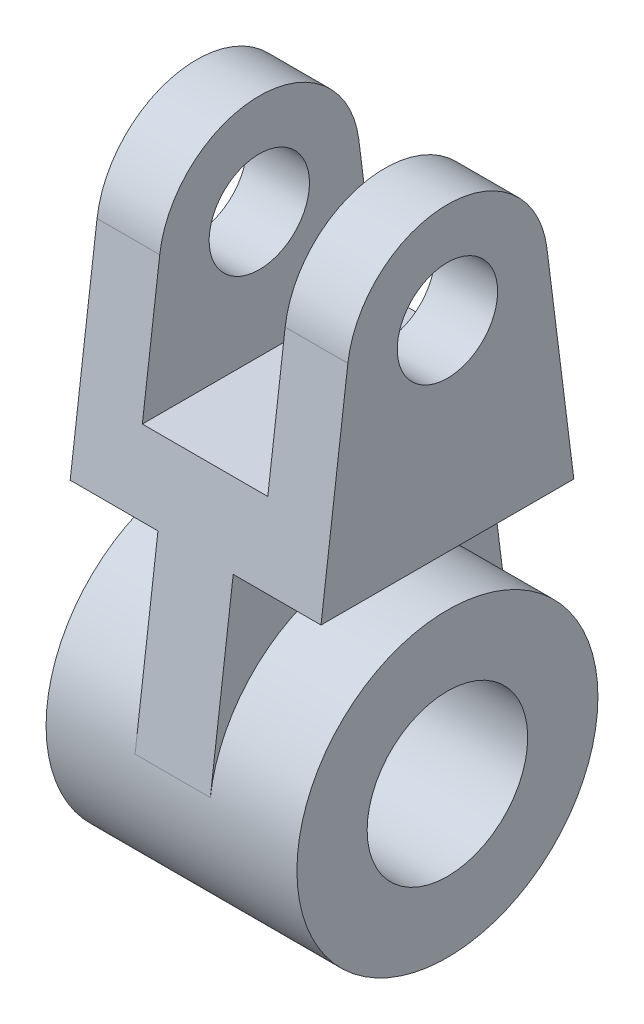
ISO-10303-21;
HEADER;
FILE_DESCRIPTION(('STEP AP214'),'2;1');
FILE_NAME('part.step','',(''),(''),'','','');
FILE_SCHEMA(('AUTOMOTIVE_DESIGN { 1 0 10303 214 1 1 1 1 }'));
ENDSEC;
DATA;
#1=APPLICATION_CONTEXT('core data for automotive mechanical design processes');
#2=APPLICATION_PROTOCOL_DEFINITION('international standard','automotive_design',2000,#1);
#3=PRODUCT_CONTEXT('',#1,'mechanical');
#4=PRODUCT('Part','Part','',(#3));
#5=PRODUCT_RELATED_PRODUCT_CATEGORY('part','',(#4));
#6=PRODUCT_DEFINITION_FORMATION('','',#4);
#7=PRODUCT_DEFINITION_CONTEXT('part definition',#1,'design');
#8=PRODUCT_DEFINITION('design','',#6,#7);
#9=PRODUCT_DEFINITION_SHAPE('','',#8);
#10=(LENGTH_UNIT() NAMED_UNIT(*) SI_UNIT(.MILLI.,.METRE.));
#11=(NAMED_UNIT(*) PLANE_ANGLE_UNIT() SI_UNIT($,.RADIAN.));
#12=(NAMED_UNIT(*) SI_UNIT($,.STERADIAN.) SOLID_ANGLE_UNIT());
#13=UNCERTAINTY_MEASURE_WITH_UNIT(LENGTH_MEASURE(1.E-05),#10,'distance_accuracy_value','');
#14=(GEOMETRIC_REPRESENTATION_CONTEXT(3) GLOBAL_UNCERTAINTY_ASSIGNED_CONTEXT((#13)) GLOBAL_UNIT_ASSIGNED_CONTEXT((#10,
#11,#12)) REPRESENTATION_CONTEXT('',''));
#15=CARTESIAN_POINT('',(0.,0.,0.));
#16=DIRECTION('',(0.,0.,1.));
#17=DIRECTION('',(1.,0.,0.));
#18=AXIS2_PLACEMENT_3D('',#15,#16,#17);
#19=CARTESIAN_POINT('',(25.,80.,0.));
#20=DIRECTION('',(-1.,0.,0.));
#21=DIRECTION('',(0.,0.,1.));
#22=AXIS2_PLACEMENT_3D('',#19,#20,#21);
#23=CYLINDRICAL_SURFACE('',#22,20.);
#24=CARTESIAN_POINT('',(-12.5,80.,0.));
#25=DIRECTION('',(-1.,0.,0.));
#26=DIRECTION('',(0.,-1.,0.));
#27=AXIS2_PLACEMENT_3D('',#24,#25,#26);
#28=CIRCLE('',#27,20.);
#29=CARTESIAN_POINT('',(-12.5,82.5,19.8431348329844));
#30=VERTEX_POINT('',#29);
#31=CARTESIAN_POINT('',(-12.5,82.5,-19.8431348329844));
#32=VERTEX_POINT('',#31);
#33=EDGE_CURVE('E152',#30,#32,#28,.T.);
#34=ORIENTED_EDGE('',*,*,#33,.T.);
#35=DIRECTION('',(-1.,0.,0.));
#36=VECTOR('',#35,1.);
#37=CARTESIAN_POINT('',(25.,82.5,-19.8431348329844));
#38=LINE('',#37,#36);
#39=CARTESIAN_POINT('',(-25.,82.5,-19.8431348329844));
#40=VERTEX_POINT('',#39);
#41=EDGE_CURVE('E150',#32,#40,#38,.T.);
#42=ORIENTED_EDGE('',*,*,#41,.T.);
#43=CARTESIAN_POINT('',(-25.,80.,0.));
#44=DIRECTION('',(1.,0.,0.));
#45=DIRECTION('',(0.,0.,-1.));
#46=AXIS2_PLACEMENT_3D('',#43,#44,#45);
#47=CIRCLE('',#46,20.);
#48=CARTESIAN_POINT('',(-25.,82.5,19.8431348329844));
#49=VERTEX_POINT('',#48);
#50=EDGE_CURVE('E201',#40,#49,#47,.T.);
#51=ORIENTED_EDGE('',*,*,#50,.T.);
#52=DIRECTION('',(-1.,0.,0.));
#53=VECTOR('',#52,1.);
#54=CARTESIAN_POINT('',(25.,82.5,19.8431348329844));
#55=LINE('',#54,#53);
#56=EDGE_CURVE('E221',#30,#49,#55,.T.);
#57=ORIENTED_EDGE('',*,*,#56,.F.);
#58=EDGE_LOOP('',(#34,#42,#51,#57));
#59=FACE_BOUND('',#58,.T.);
#60=ADVANCED_FACE('F41',(#59),#23,.T.);
#61=CARTESIAN_POINT('',(-25.,80.,0.));
#62=DIRECTION('',(1.,0.,0.));
#63=DIRECTION('',(0.,0.,-1.));
#64=AXIS2_PLACEMENT_3D('',#61,#62,#63);
#65=CYLINDRICAL_SURFACE('',#64,10.);
#66=CARTESIAN_POINT('',(12.5,80.,0.));
#67=DIRECTION('',(1.,0.,0.));
#68=DIRECTION('',(0.,1.,0.));
#69=AXIS2_PLACEMENT_3D('',#66,#67,#68);
#70=CIRCLE('',#69,10.);
#71=CARTESIAN_POINT('',(12.5,90.,0.));
#72=VERTEX_POINT('',#71);
#73=EDGE_CURVE('E156',#72,#72,#70,.F.);
#74=ORIENTED_EDGE('',*,*,#73,.T.);
#75=EDGE_LOOP('',(#74));
#76=FACE_BOUND('',#75,.T.);
#77=CARTESIAN_POINT('',(25.,80.,0.));
#78=DIRECTION('',(1.,0.,0.));
#79=DIRECTION('',(0.,0.,-1.));
#80=AXIS2_PLACEMENT_3D('',#77,#78,#79);
#81=CIRCLE('',#80,10.);
#82=CARTESIAN_POINT('',(25.,80.,-10.));
#83=VERTEX_POINT('',#82);
#84=EDGE_CURVE('E175',#83,#83,#81,.T.);
#85=ORIENTED_EDGE('',*,*,#84,.T.);
#86=EDGE_LOOP('',(#85));
#87=FACE_BOUND('',#86,.T.);
#88=ADVANCED_FACE('F283',(#76,#87),#65,.F.);
#89=CARTESIAN_POINT('',(25.,0.,0.));
#90=DIRECTION('',(-1.,0.,0.));
#91=DIRECTION('',(0.,0.,1.));
#92=AXIS2_PLACEMENT_3D('',#89,#90,#91);
#93=CYLINDRICAL_SURFACE('',#92,30.);
#94=DIRECTION('',(-1.,0.,0.));
#95=VECTOR('',#94,1.);
#96=CARTESIAN_POINT('',(7.5,3.75,-29.7647022494766));
#97=LINE('',#96,#95);
#98=CARTESIAN_POINT('',(7.5,3.75,-29.7647022494766));
#99=VERTEX_POINT('',#98);
#100=CARTESIAN_POINT('',(-7.5,3.75,-29.7647022494766));
#101=VERTEX_POINT('',#100);
#102=EDGE_CURVE('E62',#99,#101,#97,.T.);
#103=ORIENTED_EDGE('',*,*,#102,.F.);
#104=CARTESIAN_POINT('',(7.5,0.,0.));
#105=DIRECTION('',(1.,0.,0.));
#106=DIRECTION('',(0.,0.,-1.));
#107=AXIS2_PLACEMENT_3D('',#104,#105,#106);
#108=CIRCLE('',#107,30.);
#109=CARTESIAN_POINT('',(7.5,3.75,29.7647022494766));
#110=VERTEX_POINT('',#109);
#111=EDGE_CURVE('E57',#99,#110,#108,.T.);
#112=ORIENTED_EDGE('',*,*,#111,.T.);
#113=DIRECTION('',(-1.,0.,0.));
#114=VECTOR('',#113,1.);
#115=CARTESIAN_POINT('',(7.5,3.75,29.7647022494766));
#116=LINE('',#115,#114);
#117=CARTESIAN_POINT('',(-7.5,3.75,29.7647022494766));
#118=VERTEX_POINT('',#117);
#119=EDGE_CURVE('E259',#110,#118,#116,.T.);
#120=ORIENTED_EDGE('',*,*,#119,.T.);
#121=CARTESIAN_POINT('',(-7.5,0.,0.));
#122=DIRECTION('',(1.,0.,0.));
#123=DIRECTION('',(0.,0.,-1.));
#124=AXIS2_PLACEMENT_3D('',#121,#122,#123);
#125=CIRCLE('',#124,30.);
#126=EDGE_CURVE('E251',#101,#118,#125,.T.);
#127=ORIENTED_EDGE('',*,*,#126,.F.);
#128=EDGE_LOOP('',(#103,#112,#120,#127));
#129=FACE_BOUND('',#128,.T.);
#130=CARTESIAN_POINT('',(25.,0.,0.));
#131=DIRECTION('',(1.,0.,0.));
#132=DIRECTION('',(0.,0.,-1.));
#133=AXIS2_PLACEMENT_3D('',#130,#131,#132);
#134=CIRCLE('',#133,30.);
#135=CARTESIAN_POINT('',(25.,0.,-30.));
#136=VERTEX_POINT('',#135);
#137=EDGE_CURVE('E50',#136,#136,#134,.T.);
#138=ORIENTED_EDGE('',*,*,#137,.F.);
#139=EDGE_LOOP('',(#138));
#140=FACE_BOUND('',#139,.T.);
#141=CARTESIAN_POINT('',(-25.,0.,0.));
#142=DIRECTION('',(1.,0.,0.));
#143=DIRECTION('',(0.,0.,-1.));
#144=AXIS2_PLACEMENT_3D('',#141,#142,#143);
#145=CIRCLE('',#144,30.);
#146=CARTESIAN_POINT('',(-25.,0.,-30.));
#147=VERTEX_POINT('',#146);
#148=EDGE_CURVE('E267',#147,#147,#145,.T.);
#149=ORIENTED_EDGE('',*,*,#148,.T.);
#150=EDGE_LOOP('',(#149));
#151=FACE_BOUND('',#150,.T.);
#152=ADVANCED_FACE('F43',(#129,#140,#151),#93,.T.);
#153=CARTESIAN_POINT('',(25.,0.,0.));
#154=DIRECTION('',(1.,0.,0.));
#155=DIRECTION('',(0.,0.,-1.));
#156=AXIS2_PLACEMENT_3D('',#153,#154,#155);
#157=PLANE('',#156);
#158=CARTESIAN_POINT('',(25.,0.,0.));
#159=DIRECTION('',(1.,0.,0.));
#160=DIRECTION('',(0.,0.,-1.));
#161=AXIS2_PLACEMENT_3D('',#158,#159,#160);
#162=CIRCLE('',#161,16.);
#163=CARTESIAN_POINT('',(25.,0.,-16.));
#164=VERTEX_POINT('',#163);
#165=EDGE_CURVE('E262',#164,#164,#162,.T.);
#166=ORIENTED_EDGE('',*,*,#165,.F.);
#167=EDGE_LOOP('',(#166));
#168=FACE_BOUND('',#167,.T.);
#169=ORIENTED_EDGE('',*,*,#137,.T.);
#170=EDGE_LOOP('',(#169));
#171=FACE_BOUND('',#170,.T.);
#172=ADVANCED_FACE('F373',(#168,#171),#157,.T.);
#173=CARTESIAN_POINT('',(-25.,0.,0.));
#174=DIRECTION('',(1.,0.,0.));
#175=DIRECTION('',(0.,0.,-1.));
#176=AXIS2_PLACEMENT_3D('',#173,#174,#175);
#177=PLANE('',#176);
#178=CARTESIAN_POINT('',(-25.,0.,0.));
#179=DIRECTION('',(1.,0.,0.));
#180=DIRECTION('',(0.,0.,-1.));
#181=AXIS2_PLACEMENT_3D('',#178,#179,#180);
#182=CIRCLE('',#181,16.);
#183=CARTESIAN_POINT('',(-25.,0.,-16.));
#184=VERTEX_POINT('',#183);
#185=EDGE_CURVE('E263',#184,#184,#182,.T.);
#186=ORIENTED_EDGE('',*,*,#185,.T.);
#187=EDGE_LOOP('',(#186));
#188=FACE_BOUND('',#187,.T.);
#189=ORIENTED_EDGE('',*,*,#148,.F.);
#190=EDGE_LOOP('',(#189));
#191=FACE_BOUND('',#190,.T.);
#192=ADVANCED_FACE('F371',(#188,#191),#177,.F.);
#193=CARTESIAN_POINT('',(-25.,0.,0.));
#194=DIRECTION('',(1.,0.,0.));
#195=DIRECTION('',(0.,0.,-1.));
#196=AXIS2_PLACEMENT_3D('',#193,#194,#195);
#197=CYLINDRICAL_SURFACE('',#196,16.);
#198=ORIENTED_EDGE('',*,*,#185,.F.);
#199=EDGE_LOOP('',(#198));
#200=FACE_BOUND('',#199,.T.);
#201=ORIENTED_EDGE('',*,*,#165,.T.);
#202=EDGE_LOOP('',(#201));
#203=FACE_BOUND('',#202,.T.);
#204=ADVANCED_FACE('F368',(#200,#203),#197,.F.);
#205=CARTESIAN_POINT('',(7.5,3.75,29.7647022494766));
#206=DIRECTION('',(0.,-0.125,-0.992156741649222));
#207=DIRECTION('',(0.,0.992156741649222,-0.125));
#208=AXIS2_PLACEMENT_3D('',#205,#206,#207);
#209=PLANE('',#208);
#210=CARTESIAN_POINT('',(25.,82.5,19.8431348329844));
#211=VERTEX_POINT('',#210);
#212=CARTESIAN_POINT('',(12.5,82.5,19.8431348329844));
#213=VERTEX_POINT('',#212);
#214=EDGE_CURVE('E222',#211,#213,#55,.T.);
#215=ORIENTED_EDGE('',*,*,#214,.T.);
#216=DIRECTION('',(0.,-0.992156741649222,0.125));
#217=VECTOR('',#216,1.);
#218=CARTESIAN_POINT('',(12.5,3.75,29.7647022494766));
#219=LINE('',#218,#217);
#220=CARTESIAN_POINT('',(12.5,55.,23.3078091689023));
#221=VERTEX_POINT('',#220);
#222=EDGE_CURVE('E168',#213,#221,#219,.T.);
#223=ORIENTED_EDGE('',*,*,#222,.T.);
#224=DIRECTION('',(-1.,0.,0.));
#225=VECTOR('',#224,1.);
#226=CARTESIAN_POINT('',(7.5,55.,23.3078091689023));
#227=LINE('',#226,#225);
#228=CARTESIAN_POINT('',(-12.5,55.,23.3078091689023));
#229=VERTEX_POINT('',#228);
#230=EDGE_CURVE('E172',#221,#229,#227,.T.);
#231=ORIENTED_EDGE('',*,*,#230,.T.);
#232=DIRECTION('',(0.,0.992156741649222,-0.125));
#233=VECTOR('',#232,1.);
#234=CARTESIAN_POINT('',(-12.5,3.74999999999999,29.7647022494766));
#235=LINE('',#234,#233);
#236=EDGE_CURVE('E145',#229,#30,#235,.T.);
#237=ORIENTED_EDGE('',*,*,#236,.T.);
#238=ORIENTED_EDGE('',*,*,#56,.T.);
#239=DIRECTION('',(0.,-0.992156741649222,0.125));
#240=VECTOR('',#239,1.);
#241=CARTESIAN_POINT('',(-25.,3.75,29.7647022494766));
#242=LINE('',#241,#240);
#243=CARTESIAN_POINT('',(-25.,40.,25.1976315339485));
#244=VERTEX_POINT('',#243);
#245=EDGE_CURVE('E205',#49,#244,#242,.T.);
#246=ORIENTED_EDGE('',*,*,#245,.T.);
#247=DIRECTION('',(-1.,0.,0.));
#248=VECTOR('',#247,1.);
#249=CARTESIAN_POINT('',(25.,40.,25.1976315339485));
#250=LINE('',#249,#248);
#251=CARTESIAN_POINT('',(-7.5,40.,25.1976315339485));
#252=VERTEX_POINT('',#251);
#253=EDGE_CURVE('E216',#252,#244,#250,.T.);
#254=ORIENTED_EDGE('',*,*,#253,.F.);
#255=DIRECTION('',(0.,-0.992156741649222,0.125));
#256=VECTOR('',#255,1.);
#257=CARTESIAN_POINT('',(-7.5,3.75,29.7647022494766));
#258=LINE('',#257,#256);
#259=EDGE_CURVE('E247',#252,#118,#258,.T.);
#260=ORIENTED_EDGE('',*,*,#259,.T.);
#261=ORIENTED_EDGE('',*,*,#119,.F.);
#262=DIRECTION('',(0.,-0.992156741649222,0.125));
#263=VECTOR('',#262,1.);
#264=CARTESIAN_POINT('',(7.5,3.75,29.7647022494766));
#265=LINE('',#264,#263);
#266=CARTESIAN_POINT('',(7.5,40.,25.1976315339485));
#267=VERTEX_POINT('',#266);
#268=EDGE_CURVE('E235',#267,#110,#265,.T.);
#269=ORIENTED_EDGE('',*,*,#268,.F.);
#270=CARTESIAN_POINT('',(25.,40.,25.1976315339485));
#271=VERTEX_POINT('',#270);
#272=EDGE_CURVE('E217',#271,#267,#250,.T.);
#273=ORIENTED_EDGE('',*,*,#272,.F.);
#274=DIRECTION('',(0.,-0.992156741649222,0.125));
#275=VECTOR('',#274,1.);
#276=CARTESIAN_POINT('',(25.,3.75,29.7647022494766));
#277=LINE('',#276,#275);
#278=EDGE_CURVE('E192',#211,#271,#277,.T.);
#279=ORIENTED_EDGE('',*,*,#278,.F.);
#280=EDGE_LOOP('',(#215,#223,#231,#237,#238,#246,#254,#260,#261,#269,#273,#279));
#281=FACE_BOUND('',#280,.T.);
#282=ADVANCED_FACE('F308',(#281),#209,.F.);
#283=CARTESIAN_POINT('',(7.5,3.75,-29.7647022494766));
#284=DIRECTION('',(0.,-0.125,0.992156741649222));
#285=DIRECTION('',(0.,-0.992156741649222,-0.125));
#286=AXIS2_PLACEMENT_3D('',#283,#284,#285);
#287=PLANE('',#286);
#288=DIRECTION('',(1.,0.,0.));
#289=VECTOR('',#288,1.);
#290=CARTESIAN_POINT('',(7.5,55.,-23.3078091689023));
#291=LINE('',#290,#289);
#292=CARTESIAN_POINT('',(-12.5,55.,-23.3078091689023));
#293=VERTEX_POINT('',#292);
#294=CARTESIAN_POINT('',(12.5,55.,-23.3078091689023));
#295=VERTEX_POINT('',#294);
#296=EDGE_CURVE('E11',#293,#295,#291,.T.);
#297=ORIENTED_EDGE('',*,*,#296,.T.);
#298=DIRECTION('',(0.,0.992156741649222,0.125));
#299=VECTOR('',#298,1.);
#300=CARTESIAN_POINT('',(12.5,3.75,-29.7647022494766));
#301=LINE('',#300,#299);
#302=CARTESIAN_POINT('',(12.5,82.5,-19.8431348329844));
#303=VERTEX_POINT('',#302);
#304=EDGE_CURVE('E165',#295,#303,#301,.T.);
#305=ORIENTED_EDGE('',*,*,#304,.T.);
#306=CARTESIAN_POINT('',(25.,82.5,-19.8431348329844));
#307=VERTEX_POINT('',#306);
#308=EDGE_CURVE('E226',#307,#303,#38,.T.);
#309=ORIENTED_EDGE('',*,*,#308,.F.);
#310=DIRECTION('',(0.,0.992156741649222,0.125));
#311=VECTOR('',#310,1.);
#312=CARTESIAN_POINT('',(25.,3.75,-29.7647022494766));
#313=LINE('',#312,#311);
#314=CARTESIAN_POINT('',(25.,40.,-25.1976315339485));
#315=VERTEX_POINT('',#314);
#316=EDGE_CURVE('E184',#315,#307,#313,.T.);
#317=ORIENTED_EDGE('',*,*,#316,.F.);
#318=DIRECTION('',(-1.,0.,0.));
#319=VECTOR('',#318,1.);
#320=CARTESIAN_POINT('',(25.,40.,-25.1976315339485));
#321=LINE('',#320,#319);
#322=CARTESIAN_POINT('',(7.5,40.,-25.1976315339485));
#323=VERTEX_POINT('',#322);
#324=EDGE_CURVE('E212',#315,#323,#321,.T.);
#325=ORIENTED_EDGE('',*,*,#324,.T.);
#326=DIRECTION('',(0.,0.992156741649222,0.125));
#327=VECTOR('',#326,1.);
#328=CARTESIAN_POINT('',(7.5,3.75,-29.7647022494766));
#329=LINE('',#328,#327);
#330=EDGE_CURVE('E241',#99,#323,#329,.T.);
#331=ORIENTED_EDGE('',*,*,#330,.F.);
#332=ORIENTED_EDGE('',*,*,#102,.T.);
#333=DIRECTION('',(0.,0.992156741649222,0.125));
#334=VECTOR('',#333,1.);
#335=CARTESIAN_POINT('',(-7.5,3.75,-29.7647022494766));
#336=LINE('',#335,#334);
#337=CARTESIAN_POINT('',(-7.5,40.,-25.1976315339485));
#338=VERTEX_POINT('',#337);
#339=EDGE_CURVE('E236',#101,#338,#336,.T.);
#340=ORIENTED_EDGE('',*,*,#339,.T.);
#341=CARTESIAN_POINT('',(-25.,40.,-25.1976315339485));
#342=VERTEX_POINT('',#341);
#343=EDGE_CURVE('E198',#338,#342,#321,.T.);
#344=ORIENTED_EDGE('',*,*,#343,.T.);
#345=DIRECTION('',(0.,0.992156741649222,0.125));
#346=VECTOR('',#345,1.);
#347=CARTESIAN_POINT('',(-25.,3.75,-29.7647022494766));
#348=LINE('',#347,#346);
#349=EDGE_CURVE('E180',#342,#40,#348,.T.);
#350=ORIENTED_EDGE('',*,*,#349,.T.);
#351=ORIENTED_EDGE('',*,*,#41,.F.);
#352=DIRECTION('',(0.,-0.992156741649222,-0.125));
#353=VECTOR('',#352,1.);
#354=CARTESIAN_POINT('',(-12.5,3.74999999999999,-29.7647022494766));
#355=LINE('',#354,#353);
#356=EDGE_CURVE('E142',#32,#293,#355,.T.);
#357=ORIENTED_EDGE('',*,*,#356,.T.);
#358=EDGE_LOOP('',(#297,#305,#309,#317,#325,#331,#332,#340,#344,#350,#351,#357));
#359=FACE_BOUND('',#358,.T.);
#360=ADVANCED_FACE('F148',(#359),#287,.F.);
#361=CARTESIAN_POINT('',(7.5,0.,0.));
#362=DIRECTION('',(1.,0.,0.));
#363=DIRECTION('',(0.,0.,-1.));
#364=AXIS2_PLACEMENT_3D('',#361,#362,#363);
#365=PLANE('',#364);
#366=DIRECTION('',(0.,0.,-1.));
#367=VECTOR('',#366,1.);
#368=CARTESIAN_POINT('',(7.5,40.,0.));
#369=LINE('',#368,#367);
#370=EDGE_CURVE('E231',#267,#323,#369,.T.);
#371=ORIENTED_EDGE('',*,*,#370,.F.);
#372=ORIENTED_EDGE('',*,*,#268,.T.);
#373=ORIENTED_EDGE('',*,*,#111,.F.);
#374=ORIENTED_EDGE('',*,*,#330,.T.);
#375=EDGE_LOOP('',(#371,#372,#373,#374));
#376=FACE_BOUND('',#375,.T.);
#377=ADVANCED_FACE('F305',(#376),#365,.T.);
#378=CARTESIAN_POINT('',(-7.5,0.,0.));
#379=DIRECTION('',(1.,0.,0.));
#380=DIRECTION('',(0.,0.,-1.));
#381=AXIS2_PLACEMENT_3D('',#378,#379,#380);
#382=PLANE('',#381);
#383=DIRECTION('',(0.,0.,-1.));
#384=VECTOR('',#383,1.);
#385=CARTESIAN_POINT('',(-7.5,40.,0.));
#386=LINE('',#385,#384);
#387=EDGE_CURVE('E230',#252,#338,#386,.T.);
#388=ORIENTED_EDGE('',*,*,#387,.T.);
#389=ORIENTED_EDGE('',*,*,#339,.F.);
#390=ORIENTED_EDGE('',*,*,#126,.T.);
#391=ORIENTED_EDGE('',*,*,#259,.F.);
#392=EDGE_LOOP('',(#388,#389,#390,#391));
#393=FACE_BOUND('',#392,.T.);
#394=ADVANCED_FACE('F313',(#393),#382,.F.);
#395=CARTESIAN_POINT('',(25.,40.,0.));
#396=DIRECTION('',(0.,1.,0.));
#397=DIRECTION('',(0.,0.,1.));
#398=AXIS2_PLACEMENT_3D('',#395,#396,#397);
#399=PLANE('',#398);
#400=ORIENTED_EDGE('',*,*,#272,.T.);
#401=ORIENTED_EDGE('',*,*,#370,.T.);
#402=ORIENTED_EDGE('',*,*,#324,.F.);
#403=DIRECTION('',(0.,0.,-1.));
#404=VECTOR('',#403,1.);
#405=CARTESIAN_POINT('',(25.,40.,0.));
#406=LINE('',#405,#404);
#407=EDGE_CURVE('E195',#271,#315,#406,.T.);
#408=ORIENTED_EDGE('',*,*,#407,.F.);
#409=EDGE_LOOP('',(#400,#401,#402,#408));
#410=FACE_BOUND('',#409,.T.);
#411=ADVANCED_FACE('F301',(#410),#399,.F.);
#412=ORIENTED_EDGE('',*,*,#308,.T.);
#413=CARTESIAN_POINT('',(12.5,80.,0.));
#414=DIRECTION('',(1.,0.,0.));
#415=DIRECTION('',(0.,1.,0.));
#416=AXIS2_PLACEMENT_3D('',#413,#414,#415);
#417=CIRCLE('',#416,20.);
#418=EDGE_CURVE('E161',#303,#213,#417,.T.);
#419=ORIENTED_EDGE('',*,*,#418,.T.);
#420=ORIENTED_EDGE('',*,*,#214,.F.);
#421=CARTESIAN_POINT('',(25.,80.,0.));
#422=DIRECTION('',(1.,0.,0.));
#423=DIRECTION('',(0.,0.,-1.));
#424=AXIS2_PLACEMENT_3D('',#421,#422,#423);
#425=CIRCLE('',#424,20.);
#426=EDGE_CURVE('E188',#307,#211,#425,.T.);
#427=ORIENTED_EDGE('',*,*,#426,.F.);
#428=EDGE_LOOP('',(#412,#419,#420,#427));
#429=FACE_BOUND('',#428,.T.);
#430=ADVANCED_FACE('F294',(#429),#23,.T.);
#431=ORIENTED_EDGE('',*,*,#387,.F.);
#432=ORIENTED_EDGE('',*,*,#253,.T.);
#433=DIRECTION('',(0.,0.,-1.));
#434=VECTOR('',#433,1.);
#435=CARTESIAN_POINT('',(-25.,40.,0.));
#436=LINE('',#435,#434);
#437=EDGE_CURVE('E189',#244,#342,#436,.T.);
#438=ORIENTED_EDGE('',*,*,#437,.T.);
#439=ORIENTED_EDGE('',*,*,#343,.F.);
#440=EDGE_LOOP('',(#431,#432,#438,#439));
#441=FACE_BOUND('',#440,.T.);
#442=ADVANCED_FACE('F317',(#441),#399,.F.);
#443=CARTESIAN_POINT('',(25.,0.,0.));
#444=DIRECTION('',(1.,0.,0.));
#445=DIRECTION('',(0.,0.,-1.));
#446=AXIS2_PLACEMENT_3D('',#443,#444,#445);
#447=PLANE('',#446);
#448=ORIENTED_EDGE('',*,*,#84,.F.);
#449=EDGE_LOOP('',(#448));
#450=FACE_BOUND('',#449,.T.);
#451=ORIENTED_EDGE('',*,*,#316,.T.);
#452=ORIENTED_EDGE('',*,*,#426,.T.);
#453=ORIENTED_EDGE('',*,*,#278,.T.);
#454=ORIENTED_EDGE('',*,*,#407,.T.);
#455=EDGE_LOOP('',(#451,#452,#453,#454));
#456=FACE_BOUND('',#455,.T.);
#457=ADVANCED_FACE('F297',(#450,#456),#447,.T.);
#458=CARTESIAN_POINT('',(-25.,0.,0.));
#459=DIRECTION('',(1.,0.,0.));
#460=DIRECTION('',(0.,0.,-1.));
#461=AXIS2_PLACEMENT_3D('',#458,#459,#460);
#462=PLANE('',#461);
#463=CARTESIAN_POINT('',(-25.,80.,0.));
#464=DIRECTION('',(1.,0.,0.));
#465=DIRECTION('',(0.,0.,-1.));
#466=AXIS2_PLACEMENT_3D('',#463,#464,#465);
#467=CIRCLE('',#466,10.);
#468=CARTESIAN_POINT('',(-25.,80.,-10.));
#469=VERTEX_POINT('',#468);
#470=EDGE_CURVE('E176',#469,#469,#467,.T.);
#471=ORIENTED_EDGE('',*,*,#470,.T.);
#472=EDGE_LOOP('',(#471));
#473=FACE_BOUND('',#472,.T.);
#474=ORIENTED_EDGE('',*,*,#349,.F.);
#475=ORIENTED_EDGE('',*,*,#437,.F.);
#476=ORIENTED_EDGE('',*,*,#245,.F.);
#477=ORIENTED_EDGE('',*,*,#50,.F.);
#478=EDGE_LOOP('',(#474,#475,#476,#477));
#479=FACE_BOUND('',#478,.T.);
#480=ADVANCED_FACE('F329',(#473,#479),#462,.F.);
#481=CARTESIAN_POINT('',(-12.5,80.,0.));
#482=DIRECTION('',(-1.,0.,0.));
#483=DIRECTION('',(0.,-1.,0.));
#484=AXIS2_PLACEMENT_3D('',#481,#482,#483);
#485=CIRCLE('',#484,10.);
#486=CARTESIAN_POINT('',(-12.5,70.,0.));
#487=VERTEX_POINT('',#486);
#488=EDGE_CURVE('E158',#487,#487,#485,.F.);
#489=ORIENTED_EDGE('',*,*,#488,.T.);
#490=EDGE_LOOP('',(#489));
#491=FACE_BOUND('',#490,.T.);
#492=ORIENTED_EDGE('',*,*,#470,.F.);
#493=EDGE_LOOP('',(#492));
#494=FACE_BOUND('',#493,.T.);
#495=ADVANCED_FACE('F333',(#491,#494),#65,.F.);
#496=CARTESIAN_POINT('',(12.5,55.,-30.));
#497=DIRECTION('',(0.,-1.,0.));
#498=DIRECTION('',(0.,0.,-1.));
#499=AXIS2_PLACEMENT_3D('',#496,#497,#498);
#500=PLANE('',#499);
#501=DIRECTION('',(0.,0.,1.));
#502=VECTOR('',#501,1.);
#503=CARTESIAN_POINT('',(12.5,55.,-30.));
#504=LINE('',#503,#502);
#505=EDGE_CURVE('E135',#295,#221,#504,.T.);
#506=ORIENTED_EDGE('',*,*,#505,.F.);
#507=ORIENTED_EDGE('',*,*,#296,.F.);
#508=DIRECTION('',(0.,0.,1.));
#509=VECTOR('',#508,1.);
#510=CARTESIAN_POINT('',(-12.5,55.,-30.));
#511=LINE('',#510,#509);
#512=EDGE_CURVE('E132',#293,#229,#511,.T.);
#513=ORIENTED_EDGE('',*,*,#512,.T.);
#514=ORIENTED_EDGE('',*,*,#230,.F.);
#515=EDGE_LOOP('',(#506,#507,#513,#514));
#516=FACE_BOUND('',#515,.T.);
#517=ADVANCED_FACE('F131',(#516),#500,.F.);
#518=CARTESIAN_POINT('',(12.5,100.,-30.));
#519=DIRECTION('',(1.,0.,0.));
#520=DIRECTION('',(0.,1.,0.));
#521=AXIS2_PLACEMENT_3D('',#518,#519,#520);
#522=PLANE('',#521);
#523=ORIENTED_EDGE('',*,*,#73,.F.);
#524=EDGE_LOOP('',(#523));
#525=FACE_BOUND('',#524,.T.);
#526=ORIENTED_EDGE('',*,*,#418,.F.);
#527=ORIENTED_EDGE('',*,*,#304,.F.);
#528=ORIENTED_EDGE('',*,*,#505,.T.);
#529=ORIENTED_EDGE('',*,*,#222,.F.);
#530=EDGE_LOOP('',(#526,#527,#528,#529));
#531=FACE_BOUND('',#530,.T.);
#532=ADVANCED_FACE('F286',(#525,#531),#522,.F.);
#533=CARTESIAN_POINT('',(-12.5,100.,-30.));
#534=DIRECTION('',(-1.,0.,0.));
#535=DIRECTION('',(0.,-1.,0.));
#536=AXIS2_PLACEMENT_3D('',#533,#534,#535);
#537=PLANE('',#536);
#538=ORIENTED_EDGE('',*,*,#488,.F.);
#539=EDGE_LOOP('',(#538));
#540=FACE_BOUND('',#539,.T.);
#541=ORIENTED_EDGE('',*,*,#512,.F.);
#542=ORIENTED_EDGE('',*,*,#356,.F.);
#543=ORIENTED_EDGE('',*,*,#33,.F.);
#544=ORIENTED_EDGE('',*,*,#236,.F.);
#545=EDGE_LOOP('',(#541,#542,#543,#544));
#546=FACE_BOUND('',#545,.T.);
#547=ADVANCED_FACE('F141',(#540,#546),#537,.F.);
#548=CLOSED_SHELL('',(#60,#88,#152,#172,#192,#204,#282,#360,#377,#394,#411,#430,#442,#457,#480,
#495,#517,#532,#547));
#549=MANIFOLD_SOLID_BREP('B2',#548);
#550=ADVANCED_BREP_SHAPE_REPRESENTATION('',(#18,#549),#14);
#551=SHAPE_DEFINITION_REPRESENTATION(#9,#550);
ENDSEC;
END-ISO-10303-21;
